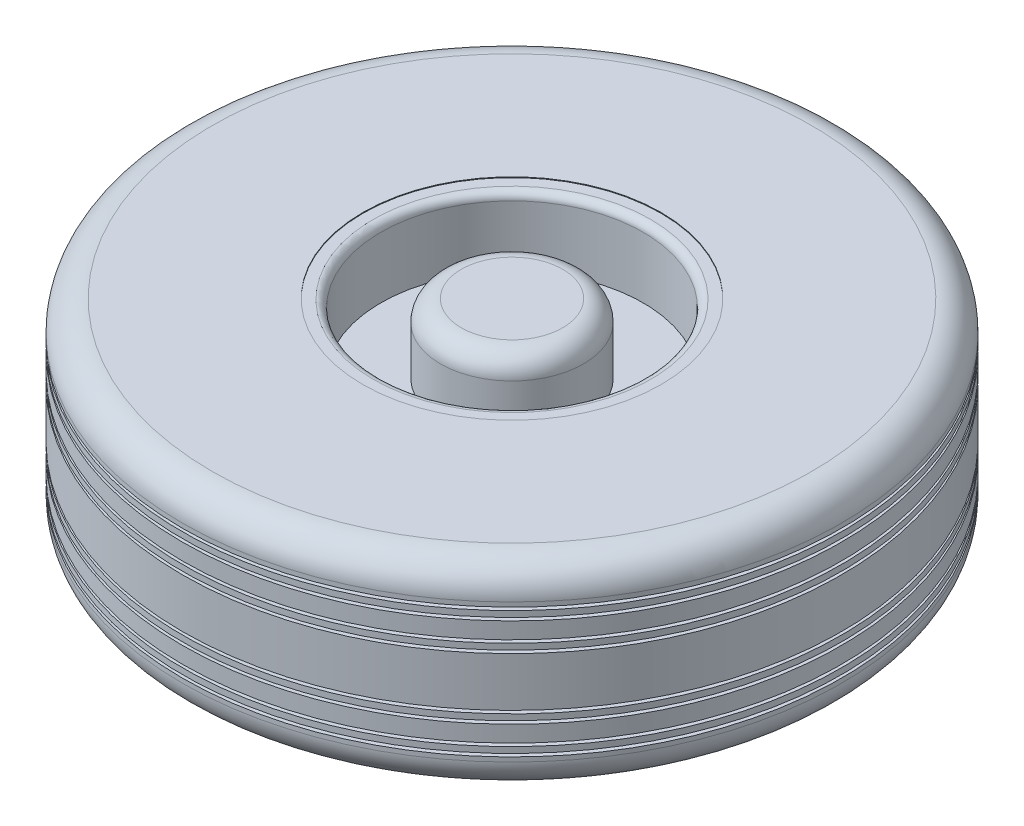
ISO-10303-21;
HEADER;
FILE_DESCRIPTION(('STEP AP214'),'2;1');
FILE_NAME('part.step','',(''),(''),'','','');
FILE_SCHEMA(('AUTOMOTIVE_DESIGN { 1 0 10303 214 1 1 1 1 }'));
ENDSEC;
DATA;
#1=APPLICATION_CONTEXT('core data for automotive mechanical design processes');
#2=APPLICATION_PROTOCOL_DEFINITION('international standard','automotive_design',2000,#1);
#3=PRODUCT_CONTEXT('',#1,'mechanical');
#4=PRODUCT('Part','Part','',(#3));
#5=PRODUCT_RELATED_PRODUCT_CATEGORY('part','',(#4));
#6=PRODUCT_DEFINITION_FORMATION('','',#4);
#7=PRODUCT_DEFINITION_CONTEXT('part definition',#1,'design');
#8=PRODUCT_DEFINITION('design','',#6,#7);
#9=PRODUCT_DEFINITION_SHAPE('','',#8);
#10=(LENGTH_UNIT() NAMED_UNIT(*) SI_UNIT(.MILLI.,.METRE.));
#11=(NAMED_UNIT(*) PLANE_ANGLE_UNIT() SI_UNIT($,.RADIAN.));
#12=(NAMED_UNIT(*) SI_UNIT($,.STERADIAN.) SOLID_ANGLE_UNIT());
#13=UNCERTAINTY_MEASURE_WITH_UNIT(LENGTH_MEASURE(1.E-05),#10,'distance_accuracy_value','');
#14=(GEOMETRIC_REPRESENTATION_CONTEXT(3) GLOBAL_UNCERTAINTY_ASSIGNED_CONTEXT((#13)) GLOBAL_UNIT_ASSIGNED_CONTEXT((#10,
#11,#12)) REPRESENTATION_CONTEXT('',''));
#15=CARTESIAN_POINT('',(0.,0.,0.));
#16=DIRECTION('',(0.,0.,1.));
#17=DIRECTION('',(1.,0.,0.));
#18=AXIS2_PLACEMENT_3D('',#15,#16,#17);
#19=CARTESIAN_POINT('',(0.,-47.6249999999999,0.));
#20=DIRECTION('',(0.,1.,0.));
#21=DIRECTION('',(0.,0.,1.));
#22=AXIS2_PLACEMENT_3D('',#19,#20,#21);
#23=PLANE('',#22);
#24=CARTESIAN_POINT('',(0.,-47.6249999999999,0.));
#25=DIRECTION('',(0.,-1.,0.));
#26=DIRECTION('',(0.,0.,-1.));
#27=AXIS2_PLACEMENT_3D('',#24,#25,#26);
#28=CIRCLE('',#27,269.24);
#29=CARTESIAN_POINT('',(0.,-47.6249999999999,-269.24));
#30=VERTEX_POINT('',#29);
#31=EDGE_CURVE('E81',#30,#30,#28,.T.);
#32=ORIENTED_EDGE('',*,*,#31,.T.);
#33=EDGE_LOOP('',(#32));
#34=FACE_BOUND('',#33,.T.);
#35=CARTESIAN_POINT('',(0.,-47.6249999999999,0.));
#36=DIRECTION('',(0.,-1.,0.));
#37=DIRECTION('',(0.,0.,-1.));
#38=AXIS2_PLACEMENT_3D('',#35,#36,#37);
#39=CIRCLE('',#38,280.67);
#40=CARTESIAN_POINT('',(0.,-47.6249999999999,-280.67));
#41=VERTEX_POINT('',#40);
#42=EDGE_CURVE('E12',#41,#41,#39,.T.);
#43=ORIENTED_EDGE('',*,*,#42,.F.);
#44=EDGE_LOOP('',(#43));
#45=FACE_BOUND('',#44,.T.);
#46=ADVANCED_FACE('F66',(#34,#45),#23,.T.);
#47=CARTESIAN_POINT('',(0.,0.,0.));
#48=DIRECTION('',(0.,-1.,0.));
#49=DIRECTION('',(0.,0.,-1.));
#50=AXIS2_PLACEMENT_3D('',#47,#48,#49);
#51=CYLINDRICAL_SURFACE('',#50,269.24);
#52=CARTESIAN_POINT('',(0.,-52.7049999999999,0.));
#53=DIRECTION('',(0.,-1.,0.));
#54=DIRECTION('',(0.,0.,-1.));
#55=AXIS2_PLACEMENT_3D('',#52,#53,#54);
#56=CIRCLE('',#55,269.24);
#57=CARTESIAN_POINT('',(0.,-52.7049999999999,-269.24));
#58=VERTEX_POINT('',#57);
#59=EDGE_CURVE('E77',#58,#58,#56,.T.);
#60=ORIENTED_EDGE('',*,*,#59,.T.);
#61=EDGE_LOOP('',(#60));
#62=FACE_BOUND('',#61,.T.);
#63=ORIENTED_EDGE('',*,*,#31,.F.);
#64=EDGE_LOOP('',(#63));
#65=FACE_BOUND('',#64,.T.);
#66=ADVANCED_FACE('F89',(#62,#65),#51,.F.);
#67=CARTESIAN_POINT('',(0.,-52.7049999999999,0.));
#68=DIRECTION('',(0.,-1.,0.));
#69=DIRECTION('',(0.,0.,-1.));
#70=AXIS2_PLACEMENT_3D('',#67,#68,#69);
#71=PLANE('',#70);
#72=CARTESIAN_POINT('',(0.,-52.7049999999999,0.));
#73=DIRECTION('',(0.,-1.,0.));
#74=DIRECTION('',(0.,0.,-1.));
#75=AXIS2_PLACEMENT_3D('',#72,#73,#74);
#76=CIRCLE('',#75,280.67);
#77=CARTESIAN_POINT('',(0.,-52.7049999999999,-280.67));
#78=VERTEX_POINT('',#77);
#79=EDGE_CURVE('E73',#78,#78,#76,.T.);
#80=ORIENTED_EDGE('',*,*,#79,.T.);
#81=EDGE_LOOP('',(#80));
#82=FACE_BOUND('',#81,.T.);
#83=ORIENTED_EDGE('',*,*,#59,.F.);
#84=EDGE_LOOP('',(#83));
#85=FACE_BOUND('',#84,.T.);
#86=ADVANCED_FACE('F91',(#82,#85),#71,.T.);
#87=CARTESIAN_POINT('',(0.,-84.455,0.));
#88=DIRECTION('',(0.,1.,0.));
#89=DIRECTION('',(0.,0.,1.));
#90=AXIS2_PLACEMENT_3D('',#87,#88,#89);
#91=CYLINDRICAL_SURFACE('',#90,280.67);
#92=ORIENTED_EDGE('',*,*,#79,.F.);
#93=EDGE_LOOP('',(#92));
#94=FACE_BOUND('',#93,.T.);
#95=ORIENTED_EDGE('',*,*,#42,.T.);
#96=EDGE_LOOP('',(#95));
#97=FACE_BOUND('',#96,.T.);
#98=ADVANCED_FACE('F68',(#94,#97),#91,.T.);
#99=CLOSED_SHELL('',(#46,#66,#86,#98));
#100=MANIFOLD_SOLID_BREP('B2',#99);
#101=CARTESIAN_POINT('',(0.,-23.4949999999999,0.));
#102=DIRECTION('',(0.,1.,0.));
#103=DIRECTION('',(0.,0.,1.));
#104=AXIS2_PLACEMENT_3D('',#101,#102,#103);
#105=PLANE('',#104);
#106=CARTESIAN_POINT('',(0.,-23.4949999999999,0.));
#107=DIRECTION('',(0.,-1.,0.));
#108=DIRECTION('',(0.,0.,-1.));
#109=AXIS2_PLACEMENT_3D('',#106,#107,#108);
#110=CIRCLE('',#109,269.24);
#111=CARTESIAN_POINT('',(0.,-23.4949999999999,-269.24));
#112=VERTEX_POINT('',#111);
#113=EDGE_CURVE('E155',#112,#112,#110,.T.);
#114=ORIENTED_EDGE('',*,*,#113,.T.);
#115=EDGE_LOOP('',(#114));
#116=FACE_BOUND('',#115,.T.);
#117=CARTESIAN_POINT('',(0.,-23.4949999999999,0.));
#118=DIRECTION('',(0.,-1.,0.));
#119=DIRECTION('',(0.,0.,-1.));
#120=AXIS2_PLACEMENT_3D('',#117,#118,#119);
#121=CIRCLE('',#120,280.67);
#122=CARTESIAN_POINT('',(0.,-23.4949999999999,-280.67));
#123=VERTEX_POINT('',#122);
#124=EDGE_CURVE('E65',#123,#123,#121,.T.);
#125=ORIENTED_EDGE('',*,*,#124,.F.);
#126=EDGE_LOOP('',(#125));
#127=FACE_BOUND('',#126,.T.);
#128=ADVANCED_FACE('F140',(#116,#127),#105,.T.);
#129=CARTESIAN_POINT('',(0.,0.,0.));
#130=DIRECTION('',(0.,-1.,0.));
#131=DIRECTION('',(0.,0.,-1.));
#132=AXIS2_PLACEMENT_3D('',#129,#130,#131);
#133=CYLINDRICAL_SURFACE('',#132,269.24);
#134=CARTESIAN_POINT('',(0.,-28.5749999999999,0.));
#135=DIRECTION('',(0.,-1.,0.));
#136=DIRECTION('',(0.,0.,-1.));
#137=AXIS2_PLACEMENT_3D('',#134,#135,#136);
#138=CIRCLE('',#137,269.24);
#139=CARTESIAN_POINT('',(0.,-28.5749999999999,-269.24));
#140=VERTEX_POINT('',#139);
#141=EDGE_CURVE('E151',#140,#140,#138,.T.);
#142=ORIENTED_EDGE('',*,*,#141,.T.);
#143=EDGE_LOOP('',(#142));
#144=FACE_BOUND('',#143,.T.);
#145=ORIENTED_EDGE('',*,*,#113,.F.);
#146=EDGE_LOOP('',(#145));
#147=FACE_BOUND('',#146,.T.);
#148=ADVANCED_FACE('F163',(#144,#147),#133,.F.);
#149=CARTESIAN_POINT('',(0.,-28.5749999999999,0.));
#150=DIRECTION('',(0.,-1.,0.));
#151=DIRECTION('',(0.,0.,-1.));
#152=AXIS2_PLACEMENT_3D('',#149,#150,#151);
#153=PLANE('',#152);
#154=CARTESIAN_POINT('',(0.,-28.5749999999999,0.));
#155=DIRECTION('',(0.,-1.,0.));
#156=DIRECTION('',(0.,0.,-1.));
#157=AXIS2_PLACEMENT_3D('',#154,#155,#156);
#158=CIRCLE('',#157,280.67);
#159=CARTESIAN_POINT('',(0.,-28.5749999999999,-280.67));
#160=VERTEX_POINT('',#159);
#161=EDGE_CURVE('E147',#160,#160,#158,.T.);
#162=ORIENTED_EDGE('',*,*,#161,.T.);
#163=EDGE_LOOP('',(#162));
#164=FACE_BOUND('',#163,.T.);
#165=ORIENTED_EDGE('',*,*,#141,.F.);
#166=EDGE_LOOP('',(#165));
#167=FACE_BOUND('',#166,.T.);
#168=ADVANCED_FACE('F165',(#164,#167),#153,.T.);
#169=CARTESIAN_POINT('',(0.,-84.455,0.));
#170=DIRECTION('',(0.,1.,0.));
#171=DIRECTION('',(0.,0.,1.));
#172=AXIS2_PLACEMENT_3D('',#169,#170,#171);
#173=CYLINDRICAL_SURFACE('',#172,280.67);
#174=ORIENTED_EDGE('',*,*,#161,.F.);
#175=EDGE_LOOP('',(#174));
#176=FACE_BOUND('',#175,.T.);
#177=ORIENTED_EDGE('',*,*,#124,.T.);
#178=EDGE_LOOP('',(#177));
#179=FACE_BOUND('',#178,.T.);
#180=ADVANCED_FACE('F142',(#176,#179),#173,.T.);
#181=CLOSED_SHELL('',(#128,#148,#168,#180));
#182=MANIFOLD_SOLID_BREP('B7',#181);
#183=CARTESIAN_POINT('',(0.,23.4949999999999,0.));
#184=DIRECTION('',(0.,1.,0.));
#185=DIRECTION('',(0.,0.,1.));
#186=AXIS2_PLACEMENT_3D('',#183,#184,#185);
#187=PLANE('',#186);
#188=CARTESIAN_POINT('',(0.,23.4949999999999,0.));
#189=DIRECTION('',(0.,-1.,0.));
#190=DIRECTION('',(0.,0.,-1.));
#191=AXIS2_PLACEMENT_3D('',#188,#189,#190);
#192=CIRCLE('',#191,269.24);
#193=CARTESIAN_POINT('',(0.,23.4949999999999,-269.24));
#194=VERTEX_POINT('',#193);
#195=EDGE_CURVE('E225',#194,#194,#192,.T.);
#196=ORIENTED_EDGE('',*,*,#195,.F.);
#197=EDGE_LOOP('',(#196));
#198=FACE_BOUND('',#197,.T.);
#199=CARTESIAN_POINT('',(0.,23.4949999999999,0.));
#200=DIRECTION('',(0.,-1.,0.));
#201=DIRECTION('',(0.,0.,-1.));
#202=AXIS2_PLACEMENT_3D('',#199,#200,#201);
#203=CIRCLE('',#202,280.67);
#204=CARTESIAN_POINT('',(0.,23.4949999999999,-280.67));
#205=VERTEX_POINT('',#204);
#206=EDGE_CURVE('E229',#205,#205,#203,.T.);
#207=ORIENTED_EDGE('',*,*,#206,.T.);
#208=EDGE_LOOP('',(#207));
#209=FACE_BOUND('',#208,.T.);
#210=ADVANCED_FACE('F214',(#198,#209),#187,.F.);
#211=CARTESIAN_POINT('',(0.,0.,0.));
#212=DIRECTION('',(0.,-1.,0.));
#213=DIRECTION('',(0.,0.,-1.));
#214=AXIS2_PLACEMENT_3D('',#211,#212,#213);
#215=CYLINDRICAL_SURFACE('',#214,269.24);
#216=CARTESIAN_POINT('',(0.,28.5749999999999,0.));
#217=DIRECTION('',(0.,-1.,0.));
#218=DIRECTION('',(0.,0.,-1.));
#219=AXIS2_PLACEMENT_3D('',#216,#217,#218);
#220=CIRCLE('',#219,269.24);
#221=CARTESIAN_POINT('',(0.,28.5749999999999,-269.24));
#222=VERTEX_POINT('',#221);
#223=EDGE_CURVE('E221',#222,#222,#220,.T.);
#224=ORIENTED_EDGE('',*,*,#223,.F.);
#225=EDGE_LOOP('',(#224));
#226=FACE_BOUND('',#225,.T.);
#227=ORIENTED_EDGE('',*,*,#195,.T.);
#228=EDGE_LOOP('',(#227));
#229=FACE_BOUND('',#228,.T.);
#230=ADVANCED_FACE('F241',(#226,#229),#215,.F.);
#231=CARTESIAN_POINT('',(0.,28.5749999999999,0.));
#232=DIRECTION('',(0.,-1.,0.));
#233=DIRECTION('',(0.,0.,-1.));
#234=AXIS2_PLACEMENT_3D('',#231,#232,#233);
#235=PLANE('',#234);
#236=CARTESIAN_POINT('',(0.,28.5749999999999,0.));
#237=DIRECTION('',(0.,-1.,0.));
#238=DIRECTION('',(0.,0.,-1.));
#239=AXIS2_PLACEMENT_3D('',#236,#237,#238);
#240=CIRCLE('',#239,280.67);
#241=CARTESIAN_POINT('',(0.,28.5749999999999,-280.67));
#242=VERTEX_POINT('',#241);
#243=EDGE_CURVE('E139',#242,#242,#240,.T.);
#244=ORIENTED_EDGE('',*,*,#243,.F.);
#245=EDGE_LOOP('',(#244));
#246=FACE_BOUND('',#245,.T.);
#247=ORIENTED_EDGE('',*,*,#223,.T.);
#248=EDGE_LOOP('',(#247));
#249=FACE_BOUND('',#248,.T.);
#250=ADVANCED_FACE('F237',(#246,#249),#235,.F.);
#251=CARTESIAN_POINT('',(0.,-84.455,0.));
#252=DIRECTION('',(0.,1.,0.));
#253=DIRECTION('',(0.,0.,1.));
#254=AXIS2_PLACEMENT_3D('',#251,#252,#253);
#255=CYLINDRICAL_SURFACE('',#254,280.67);
#256=ORIENTED_EDGE('',*,*,#206,.F.);
#257=EDGE_LOOP('',(#256));
#258=FACE_BOUND('',#257,.T.);
#259=ORIENTED_EDGE('',*,*,#243,.T.);
#260=EDGE_LOOP('',(#259));
#261=FACE_BOUND('',#260,.T.);
#262=ADVANCED_FACE('F216',(#258,#261),#255,.T.);
#263=CLOSED_SHELL('',(#210,#230,#250,#262));
#264=MANIFOLD_SOLID_BREP('B60',#263);
#265=CARTESIAN_POINT('',(0.,52.7049999999999,0.));
#266=DIRECTION('',(0.,-1.,0.));
#267=DIRECTION('',(0.,0.,-1.));
#268=AXIS2_PLACEMENT_3D('',#265,#266,#267);
#269=PLANE('',#268);
#270=CARTESIAN_POINT('',(0.,52.7049999999999,0.));
#271=DIRECTION('',(0.,-1.,0.));
#272=DIRECTION('',(0.,0.,-1.));
#273=AXIS2_PLACEMENT_3D('',#270,#271,#272);
#274=CIRCLE('',#273,280.67);
#275=CARTESIAN_POINT('',(0.,52.7049999999999,-280.67));
#276=VERTEX_POINT('',#275);
#277=EDGE_CURVE('E213',#276,#276,#274,.T.);
#278=ORIENTED_EDGE('',*,*,#277,.F.);
#279=EDGE_LOOP('',(#278));
#280=FACE_BOUND('',#279,.T.);
#281=CARTESIAN_POINT('',(0.,52.7049999999999,0.));
#282=DIRECTION('',(0.,-1.,0.));
#283=DIRECTION('',(0.,0.,-1.));
#284=AXIS2_PLACEMENT_3D('',#281,#282,#283);
#285=CIRCLE('',#284,269.24);
#286=CARTESIAN_POINT('',(0.,52.7049999999999,-269.24));
#287=VERTEX_POINT('',#286);
#288=EDGE_CURVE('E291',#287,#287,#285,.T.);
#289=ORIENTED_EDGE('',*,*,#288,.T.);
#290=EDGE_LOOP('',(#289));
#291=FACE_BOUND('',#290,.T.);
#292=ADVANCED_FACE('F287',(#280,#291),#269,.F.);
#293=CARTESIAN_POINT('',(0.,47.6249999999999,0.));
#294=DIRECTION('',(0.,1.,0.));
#295=DIRECTION('',(0.,0.,1.));
#296=AXIS2_PLACEMENT_3D('',#293,#294,#295);
#297=PLANE('',#296);
#298=CARTESIAN_POINT('',(0.,47.6249999999999,0.));
#299=DIRECTION('',(0.,-1.,0.));
#300=DIRECTION('',(0.,0.,-1.));
#301=AXIS2_PLACEMENT_3D('',#298,#299,#300);
#302=CIRCLE('',#301,269.24);
#303=CARTESIAN_POINT('',(0.,47.6249999999999,-269.24));
#304=VERTEX_POINT('',#303);
#305=EDGE_CURVE('E295',#304,#304,#302,.T.);
#306=ORIENTED_EDGE('',*,*,#305,.F.);
#307=EDGE_LOOP('',(#306));
#308=FACE_BOUND('',#307,.T.);
#309=CARTESIAN_POINT('',(0.,47.6249999999999,0.));
#310=DIRECTION('',(0.,-1.,0.));
#311=DIRECTION('',(0.,0.,-1.));
#312=AXIS2_PLACEMENT_3D('',#309,#310,#311);
#313=CIRCLE('',#312,280.67);
#314=CARTESIAN_POINT('',(0.,47.6249999999999,-280.67));
#315=VERTEX_POINT('',#314);
#316=EDGE_CURVE('E300',#315,#315,#313,.T.);
#317=ORIENTED_EDGE('',*,*,#316,.T.);
#318=EDGE_LOOP('',(#317));
#319=FACE_BOUND('',#318,.T.);
#320=ADVANCED_FACE('F312',(#308,#319),#297,.F.);
#321=CARTESIAN_POINT('',(0.,0.,0.));
#322=DIRECTION('',(0.,-1.,0.));
#323=DIRECTION('',(0.,0.,-1.));
#324=AXIS2_PLACEMENT_3D('',#321,#322,#323);
#325=CYLINDRICAL_SURFACE('',#324,269.24);
#326=ORIENTED_EDGE('',*,*,#288,.F.);
#327=EDGE_LOOP('',(#326));
#328=FACE_BOUND('',#327,.T.);
#329=ORIENTED_EDGE('',*,*,#305,.T.);
#330=EDGE_LOOP('',(#329));
#331=FACE_BOUND('',#330,.T.);
#332=ADVANCED_FACE('F309',(#328,#331),#325,.F.);
#333=CARTESIAN_POINT('',(0.,-84.455,0.));
#334=DIRECTION('',(0.,1.,0.));
#335=DIRECTION('',(0.,0.,1.));
#336=AXIS2_PLACEMENT_3D('',#333,#334,#335);
#337=CYLINDRICAL_SURFACE('',#336,280.67);
#338=ORIENTED_EDGE('',*,*,#277,.T.);
#339=EDGE_LOOP('',(#338));
#340=FACE_BOUND('',#339,.T.);
#341=ORIENTED_EDGE('',*,*,#316,.F.);
#342=EDGE_LOOP('',(#341));
#343=FACE_BOUND('',#342,.T.);
#344=ADVANCED_FACE('F289',(#340,#343),#337,.T.);
#345=CLOSED_SHELL('',(#292,#320,#332,#344));
#346=MANIFOLD_SOLID_BREP('B134',#345);
#347=CARTESIAN_POINT('',(0.,-83.82,0.));
#348=DIRECTION('',(0.,1.,0.));
#349=DIRECTION('',(0.,0.,1.));
#350=AXIS2_PLACEMENT_3D('',#347,#348,#349);
#351=CYLINDRICAL_SURFACE('',#350,111.76);
#352=CARTESIAN_POINT('',(0.,-83.82,0.));
#353=DIRECTION('',(0.,1.,0.));
#354=DIRECTION('',(0.,0.,1.));
#355=AXIS2_PLACEMENT_3D('',#352,#353,#354);
#356=CIRCLE('',#355,111.76);
#357=CARTESIAN_POINT('',(0.,-83.82,111.76));
#358=VERTEX_POINT('',#357);
#359=EDGE_CURVE('E423',#358,#358,#356,.T.);
#360=ORIENTED_EDGE('',*,*,#359,.F.);
#361=EDGE_LOOP('',(#360));
#362=FACE_BOUND('',#361,.T.);
#363=CARTESIAN_POINT('',(0.,-25.4,0.));
#364=DIRECTION('',(0.,1.,0.));
#365=DIRECTION('',(0.,0.,1.));
#366=AXIS2_PLACEMENT_3D('',#363,#364,#365);
#367=CIRCLE('',#366,111.76);
#368=CARTESIAN_POINT('',(0.,-25.4,111.76));
#369=VERTEX_POINT('',#368);
#370=EDGE_CURVE('E364',#369,#369,#367,.F.);
#371=ORIENTED_EDGE('',*,*,#370,.F.);
#372=EDGE_LOOP('',(#371));
#373=FACE_BOUND('',#372,.T.);
#374=ADVANCED_FACE('F353',(#362,#373),#351,.F.);
#375=CARTESIAN_POINT('',(0.,-84.455,0.));
#376=DIRECTION('',(0.,1.,0.));
#377=DIRECTION('',(0.,0.,1.));
#378=AXIS2_PLACEMENT_3D('',#375,#376,#377);
#379=CYLINDRICAL_SURFACE('',#378,127.);
#380=CARTESIAN_POINT('',(0.,-84.455,0.));
#381=DIRECTION('',(0.,1.,0.));
#382=DIRECTION('',(0.,0.,1.));
#383=AXIS2_PLACEMENT_3D('',#380,#381,#382);
#384=CIRCLE('',#383,127.);
#385=CARTESIAN_POINT('',(0.,-84.455,127.));
#386=VERTEX_POINT('',#385);
#387=EDGE_CURVE('E385',#386,#386,#384,.T.);
#388=ORIENTED_EDGE('',*,*,#387,.F.);
#389=EDGE_LOOP('',(#388));
#390=FACE_BOUND('',#389,.T.);
#391=CARTESIAN_POINT('',(0.,-83.82,0.));
#392=DIRECTION('',(0.,1.,0.));
#393=DIRECTION('',(0.,0.,1.));
#394=AXIS2_PLACEMENT_3D('',#391,#392,#393);
#395=CIRCLE('',#394,127.);
#396=CARTESIAN_POINT('',(0.,-83.82,127.));
#397=VERTEX_POINT('',#396);
#398=EDGE_CURVE('E368',#397,#397,#395,.F.);
#399=ORIENTED_EDGE('',*,*,#398,.F.);
#400=EDGE_LOOP('',(#399));
#401=FACE_BOUND('',#400,.T.);
#402=ADVANCED_FACE('F489',(#390,#401),#379,.F.);
#403=CARTESIAN_POINT('',(0.,-84.455,0.));
#404=DIRECTION('',(0.,1.,0.));
#405=DIRECTION('',(0.,0.,1.));
#406=AXIS2_PLACEMENT_3D('',#403,#404,#405);
#407=CYLINDRICAL_SURFACE('',#406,280.67);
#408=CARTESIAN_POINT('',(0.,59.055,0.));
#409=DIRECTION('',(0.,1.,0.));
#410=DIRECTION('',(0.,0.,1.));
#411=AXIS2_PLACEMENT_3D('',#408,#409,#410);
#412=CIRCLE('',#411,280.67);
#413=CARTESIAN_POINT('',(0.,59.055,280.67));
#414=VERTEX_POINT('',#413);
#415=EDGE_CURVE('E379',#414,#414,#412,.F.);
#416=ORIENTED_EDGE('',*,*,#415,.T.);
#417=EDGE_LOOP('',(#416));
#418=FACE_BOUND('',#417,.T.);
#419=CARTESIAN_POINT('',(0.,55.2449999999999,0.));
#420=DIRECTION('',(0.,-1.,0.));
#421=DIRECTION('',(0.,0.,-1.));
#422=AXIS2_PLACEMENT_3D('',#419,#420,#421);
#423=CIRCLE('',#422,280.67);
#424=CARTESIAN_POINT('',(0.,55.2449999999999,-280.67));
#425=VERTEX_POINT('',#424);
#426=EDGE_CURVE('E386',#425,#425,#423,.F.);
#427=ORIENTED_EDGE('',*,*,#426,.T.);
#428=EDGE_LOOP('',(#427));
#429=FACE_BOUND('',#428,.T.);
#430=ADVANCED_FACE('F496',(#418,#429),#407,.T.);
#431=CARTESIAN_POINT('',(0.,-59.055,0.));
#432=DIRECTION('',(0.,1.,0.));
#433=DIRECTION('',(0.,0.,1.));
#434=AXIS2_PLACEMENT_3D('',#431,#432,#433);
#435=CIRCLE('',#434,280.67);
#436=CARTESIAN_POINT('',(0.,-59.055,280.67));
#437=VERTEX_POINT('',#436);
#438=EDGE_CURVE('E376',#437,#437,#435,.T.);
#439=ORIENTED_EDGE('',*,*,#438,.T.);
#440=EDGE_LOOP('',(#439));
#441=FACE_BOUND('',#440,.T.);
#442=CARTESIAN_POINT('',(0.,-55.2449999999999,0.));
#443=DIRECTION('',(0.,-1.,0.));
#444=DIRECTION('',(0.,0.,-1.));
#445=AXIS2_PLACEMENT_3D('',#442,#443,#444);
#446=CIRCLE('',#445,280.67);
#447=CARTESIAN_POINT('',(0.,-55.2449999999999,-280.67));
#448=VERTEX_POINT('',#447);
#449=EDGE_CURVE('E408',#448,#448,#446,.F.);
#450=ORIENTED_EDGE('',*,*,#449,.F.);
#451=EDGE_LOOP('',(#450));
#452=FACE_BOUND('',#451,.T.);
#453=ADVANCED_FACE('F565',(#441,#452),#407,.T.);
#454=CARTESIAN_POINT('',(0.,-84.455,0.));
#455=DIRECTION('',(0.,1.,0.));
#456=DIRECTION('',(0.,0.,1.));
#457=AXIS2_PLACEMENT_3D('',#454,#455,#456);
#458=PLANE('',#457);
#459=CARTESIAN_POINT('',(0.,-84.455,0.));
#460=DIRECTION('',(0.,1.,0.));
#461=DIRECTION('',(0.,0.,1.));
#462=AXIS2_PLACEMENT_3D('',#459,#460,#461);
#463=CIRCLE('',#462,255.27);
#464=CARTESIAN_POINT('',(0.,-84.455,255.27));
#465=VERTEX_POINT('',#464);
#466=EDGE_CURVE('E373',#465,#465,#463,.F.);
#467=ORIENTED_EDGE('',*,*,#466,.T.);
#468=EDGE_LOOP('',(#467));
#469=FACE_BOUND('',#468,.T.);
#470=ORIENTED_EDGE('',*,*,#387,.T.);
#471=EDGE_LOOP('',(#470));
#472=FACE_BOUND('',#471,.T.);
#473=ADVANCED_FACE('F547',(#469,#472),#458,.F.);
#474=CARTESIAN_POINT('',(0.,83.82,0.));
#475=DIRECTION('',(0.,1.,0.));
#476=DIRECTION('',(0.,0.,1.));
#477=AXIS2_PLACEMENT_3D('',#474,#475,#476);
#478=CIRCLE('',#477,127.);
#479=CARTESIAN_POINT('',(0.,83.82,127.));
#480=VERTEX_POINT('',#479);
#481=EDGE_CURVE('E442',#480,#480,#478,.T.);
#482=ORIENTED_EDGE('',*,*,#481,.F.);
#483=EDGE_LOOP('',(#482));
#484=FACE_BOUND('',#483,.T.);
#485=CARTESIAN_POINT('',(0.,84.455,0.));
#486=DIRECTION('',(0.,1.,0.));
#487=DIRECTION('',(0.,0.,1.));
#488=AXIS2_PLACEMENT_3D('',#485,#486,#487);
#489=CIRCLE('',#488,127.);
#490=CARTESIAN_POINT('',(0.,84.455,127.));
#491=VERTEX_POINT('',#490);
#492=EDGE_CURVE('E389',#491,#491,#489,.T.);
#493=ORIENTED_EDGE('',*,*,#492,.T.);
#494=EDGE_LOOP('',(#493));
#495=FACE_BOUND('',#494,.T.);
#496=ADVANCED_FACE('F499',(#484,#495),#379,.F.);
#497=CARTESIAN_POINT('',(0.,84.455,0.));
#498=DIRECTION('',(0.,1.,0.));
#499=DIRECTION('',(0.,0.,1.));
#500=AXIS2_PLACEMENT_3D('',#497,#498,#499);
#501=PLANE('',#500);
#502=CARTESIAN_POINT('',(0.,84.455,0.));
#503=DIRECTION('',(0.,1.,0.));
#504=DIRECTION('',(0.,0.,1.));
#505=AXIS2_PLACEMENT_3D('',#502,#503,#504);
#506=CIRCLE('',#505,255.27);
#507=CARTESIAN_POINT('',(0.,84.455,255.27));
#508=VERTEX_POINT('',#507);
#509=EDGE_CURVE('E382',#508,#508,#506,.T.);
#510=ORIENTED_EDGE('',*,*,#509,.T.);
#511=EDGE_LOOP('',(#510));
#512=FACE_BOUND('',#511,.T.);
#513=ORIENTED_EDGE('',*,*,#492,.F.);
#514=EDGE_LOOP('',(#513));
#515=FACE_BOUND('',#514,.T.);
#516=ADVANCED_FACE('F546',(#512,#515),#501,.T.);
#517=CARTESIAN_POINT('',(0.,-45.0849999999999,0.));
#518=DIRECTION('',(0.,1.,0.));
#519=DIRECTION('',(0.,0.,1.));
#520=AXIS2_PLACEMENT_3D('',#517,#518,#519);
#521=PLANE('',#520);
#522=CARTESIAN_POINT('',(0.,-45.0849999999999,0.));
#523=DIRECTION('',(0.,1.,0.));
#524=DIRECTION('',(0.,0.,1.));
#525=AXIS2_PLACEMENT_3D('',#522,#523,#524);
#526=CIRCLE('',#525,280.67);
#527=CARTESIAN_POINT('',(0.,-45.0849999999999,280.67));
#528=VERTEX_POINT('',#527);
#529=EDGE_CURVE('E405',#528,#528,#526,.F.);
#530=ORIENTED_EDGE('',*,*,#529,.T.);
#531=EDGE_LOOP('',(#530));
#532=FACE_BOUND('',#531,.T.);
#533=CARTESIAN_POINT('',(0.,-45.0849999999999,0.));
#534=DIRECTION('',(0.,-1.,0.));
#535=DIRECTION('',(0.,0.,-1.));
#536=AXIS2_PLACEMENT_3D('',#533,#534,#535);
#537=CIRCLE('',#536,266.7);
#538=CARTESIAN_POINT('',(0.,-45.0849999999999,-266.7));
#539=VERTEX_POINT('',#538);
#540=EDGE_CURVE('E416',#539,#539,#537,.T.);
#541=ORIENTED_EDGE('',*,*,#540,.F.);
#542=EDGE_LOOP('',(#541));
#543=FACE_BOUND('',#542,.T.);
#544=ADVANCED_FACE('F551',(#532,#543),#521,.F.);
#545=CARTESIAN_POINT('',(0.,0.,0.));
#546=DIRECTION('',(0.,-1.,0.));
#547=DIRECTION('',(0.,0.,-1.));
#548=AXIS2_PLACEMENT_3D('',#545,#546,#547);
#549=CYLINDRICAL_SURFACE('',#548,266.7);
#550=CARTESIAN_POINT('',(0.,-55.2449999999999,0.));
#551=DIRECTION('',(0.,-1.,0.));
#552=DIRECTION('',(0.,0.,-1.));
#553=AXIS2_PLACEMENT_3D('',#550,#551,#552);
#554=CIRCLE('',#553,266.7);
#555=CARTESIAN_POINT('',(0.,-55.2449999999999,-266.7));
#556=VERTEX_POINT('',#555);
#557=EDGE_CURVE('E420',#556,#556,#554,.T.);
#558=ORIENTED_EDGE('',*,*,#557,.F.);
#559=EDGE_LOOP('',(#558));
#560=FACE_BOUND('',#559,.T.);
#561=ORIENTED_EDGE('',*,*,#540,.T.);
#562=EDGE_LOOP('',(#561));
#563=FACE_BOUND('',#562,.T.);
#564=ADVANCED_FACE('F558',(#560,#563),#549,.T.);
#565=CARTESIAN_POINT('',(0.,-55.2449999999999,0.));
#566=DIRECTION('',(0.,-1.,0.));
#567=DIRECTION('',(0.,0.,-1.));
#568=AXIS2_PLACEMENT_3D('',#565,#566,#567);
#569=PLANE('',#568);
#570=ORIENTED_EDGE('',*,*,#449,.T.);
#571=EDGE_LOOP('',(#570));
#572=FACE_BOUND('',#571,.T.);
#573=ORIENTED_EDGE('',*,*,#557,.T.);
#574=EDGE_LOOP('',(#573));
#575=FACE_BOUND('',#574,.T.);
#576=ADVANCED_FACE('F630',(#572,#575),#569,.F.);
#577=CARTESIAN_POINT('',(0.,-31.1149999999999,0.));
#578=DIRECTION('',(0.,-1.,0.));
#579=DIRECTION('',(0.,0.,-1.));
#580=AXIS2_PLACEMENT_3D('',#577,#578,#579);
#581=CIRCLE('',#580,280.67);
#582=CARTESIAN_POINT('',(0.,-31.1149999999999,-280.67));
#583=VERTEX_POINT('',#582);
#584=EDGE_CURVE('E402',#583,#583,#581,.F.);
#585=ORIENTED_EDGE('',*,*,#584,.F.);
#586=EDGE_LOOP('',(#585));
#587=FACE_BOUND('',#586,.T.);
#588=ORIENTED_EDGE('',*,*,#529,.F.);
#589=EDGE_LOOP('',(#588));
#590=FACE_BOUND('',#589,.T.);
#591=ADVANCED_FACE('F570',(#587,#590),#407,.T.);
#592=CARTESIAN_POINT('',(0.,-20.9549999999999,0.));
#593=DIRECTION('',(0.,1.,0.));
#594=DIRECTION('',(0.,0.,1.));
#595=AXIS2_PLACEMENT_3D('',#592,#593,#594);
#596=PLANE('',#595);
#597=CARTESIAN_POINT('',(0.,-20.9549999999999,0.));
#598=DIRECTION('',(0.,1.,0.));
#599=DIRECTION('',(0.,0.,1.));
#600=AXIS2_PLACEMENT_3D('',#597,#598,#599);
#601=CIRCLE('',#600,280.67);
#602=CARTESIAN_POINT('',(0.,-20.9549999999999,280.67));
#603=VERTEX_POINT('',#602);
#604=EDGE_CURVE('E399',#603,#603,#601,.F.);
#605=ORIENTED_EDGE('',*,*,#604,.T.);
#606=EDGE_LOOP('',(#605));
#607=FACE_BOUND('',#606,.T.);
#608=CARTESIAN_POINT('',(0.,-20.9549999999999,0.));
#609=DIRECTION('',(0.,-1.,0.));
#610=DIRECTION('',(0.,0.,-1.));
#611=AXIS2_PLACEMENT_3D('',#608,#609,#610);
#612=CIRCLE('',#611,266.7);
#613=CARTESIAN_POINT('',(0.,-20.9549999999999,-266.7));
#614=VERTEX_POINT('',#613);
#615=EDGE_CURVE('E424',#614,#614,#612,.T.);
#616=ORIENTED_EDGE('',*,*,#615,.F.);
#617=EDGE_LOOP('',(#616));
#618=FACE_BOUND('',#617,.T.);
#619=ADVANCED_FACE('F625',(#607,#618),#596,.F.);
#620=CARTESIAN_POINT('',(0.,0.,0.));
#621=DIRECTION('',(0.,-1.,0.));
#622=DIRECTION('',(0.,0.,-1.));
#623=AXIS2_PLACEMENT_3D('',#620,#621,#622);
#624=CYLINDRICAL_SURFACE('',#623,266.7);
#625=CARTESIAN_POINT('',(0.,-31.1149999999999,0.));
#626=DIRECTION('',(0.,-1.,0.));
#627=DIRECTION('',(0.,0.,-1.));
#628=AXIS2_PLACEMENT_3D('',#625,#626,#627);
#629=CIRCLE('',#628,266.7);
#630=CARTESIAN_POINT('',(0.,-31.1149999999999,-266.7));
#631=VERTEX_POINT('',#630);
#632=EDGE_CURVE('E419',#631,#631,#629,.T.);
#633=ORIENTED_EDGE('',*,*,#632,.F.);
#634=EDGE_LOOP('',(#633));
#635=FACE_BOUND('',#634,.T.);
#636=ORIENTED_EDGE('',*,*,#615,.T.);
#637=EDGE_LOOP('',(#636));
#638=FACE_BOUND('',#637,.T.);
#639=ADVANCED_FACE('F621',(#635,#638),#624,.T.);
#640=CARTESIAN_POINT('',(0.,-31.1149999999999,0.));
#641=DIRECTION('',(0.,-1.,0.));
#642=DIRECTION('',(0.,0.,-1.));
#643=AXIS2_PLACEMENT_3D('',#640,#641,#642);
#644=PLANE('',#643);
#645=ORIENTED_EDGE('',*,*,#584,.T.);
#646=EDGE_LOOP('',(#645));
#647=FACE_BOUND('',#646,.T.);
#648=ORIENTED_EDGE('',*,*,#632,.T.);
#649=EDGE_LOOP('',(#648));
#650=FACE_BOUND('',#649,.T.);
#651=ADVANCED_FACE('F618',(#647,#650),#644,.F.);
#652=ORIENTED_EDGE('',*,*,#604,.F.);
#653=EDGE_LOOP('',(#652));
#654=FACE_BOUND('',#653,.T.);
#655=CARTESIAN_POINT('',(0.,20.9549999999999,0.));
#656=DIRECTION('',(0.,1.,0.));
#657=DIRECTION('',(0.,0.,1.));
#658=AXIS2_PLACEMENT_3D('',#655,#656,#657);
#659=CIRCLE('',#658,280.67);
#660=CARTESIAN_POINT('',(0.,20.9549999999999,280.67));
#661=VERTEX_POINT('',#660);
#662=EDGE_CURVE('E393',#661,#661,#659,.F.);
#663=ORIENTED_EDGE('',*,*,#662,.T.);
#664=EDGE_LOOP('',(#663));
#665=FACE_BOUND('',#664,.T.);
#666=ADVANCED_FACE('F579',(#654,#665),#407,.T.);
#667=CARTESIAN_POINT('',(0.,20.9549999999999,0.));
#668=DIRECTION('',(0.,1.,0.));
#669=DIRECTION('',(0.,0.,1.));
#670=AXIS2_PLACEMENT_3D('',#667,#668,#669);
#671=PLANE('',#670);
#672=ORIENTED_EDGE('',*,*,#662,.F.);
#673=EDGE_LOOP('',(#672));
#674=FACE_BOUND('',#673,.T.);
#675=CARTESIAN_POINT('',(0.,20.9549999999999,0.));
#676=DIRECTION('',(0.,-1.,0.));
#677=DIRECTION('',(0.,0.,-1.));
#678=AXIS2_PLACEMENT_3D('',#675,#676,#677);
#679=CIRCLE('',#678,266.7);
#680=CARTESIAN_POINT('',(0.,20.9549999999999,-266.7));
#681=VERTEX_POINT('',#680);
#682=EDGE_CURVE('E430',#681,#681,#679,.T.);
#683=ORIENTED_EDGE('',*,*,#682,.T.);
#684=EDGE_LOOP('',(#683));
#685=FACE_BOUND('',#684,.T.);
#686=ADVANCED_FACE('F613',(#674,#685),#671,.T.);
#687=CARTESIAN_POINT('',(0.,0.,0.));
#688=DIRECTION('',(0.,-1.,0.));
#689=DIRECTION('',(0.,0.,-1.));
#690=AXIS2_PLACEMENT_3D('',#687,#688,#689);
#691=CYLINDRICAL_SURFACE('',#690,266.7);
#692=CARTESIAN_POINT('',(0.,31.1149999999999,0.));
#693=DIRECTION('',(0.,-1.,0.));
#694=DIRECTION('',(0.,0.,-1.));
#695=AXIS2_PLACEMENT_3D('',#692,#693,#694);
#696=CIRCLE('',#695,266.7);
#697=CARTESIAN_POINT('',(0.,31.1149999999999,-266.7));
#698=VERTEX_POINT('',#697);
#699=EDGE_CURVE('E427',#698,#698,#696,.T.);
#700=ORIENTED_EDGE('',*,*,#699,.T.);
#701=EDGE_LOOP('',(#700));
#702=FACE_BOUND('',#701,.T.);
#703=ORIENTED_EDGE('',*,*,#682,.F.);
#704=EDGE_LOOP('',(#703));
#705=FACE_BOUND('',#704,.T.);
#706=ADVANCED_FACE('F609',(#702,#705),#691,.T.);
#707=CARTESIAN_POINT('',(0.,31.1149999999999,0.));
#708=DIRECTION('',(0.,-1.,0.));
#709=DIRECTION('',(0.,0.,-1.));
#710=AXIS2_PLACEMENT_3D('',#707,#708,#709);
#711=PLANE('',#710);
#712=CARTESIAN_POINT('',(0.,31.1149999999999,0.));
#713=DIRECTION('',(0.,-1.,0.));
#714=DIRECTION('',(0.,0.,-1.));
#715=AXIS2_PLACEMENT_3D('',#712,#713,#714);
#716=CIRCLE('',#715,280.67);
#717=CARTESIAN_POINT('',(0.,31.1149999999999,-280.67));
#718=VERTEX_POINT('',#717);
#719=EDGE_CURVE('E396',#718,#718,#716,.F.);
#720=ORIENTED_EDGE('',*,*,#719,.F.);
#721=EDGE_LOOP('',(#720));
#722=FACE_BOUND('',#721,.T.);
#723=ORIENTED_EDGE('',*,*,#699,.F.);
#724=EDGE_LOOP('',(#723));
#725=FACE_BOUND('',#724,.T.);
#726=ADVANCED_FACE('F592',(#722,#725),#711,.T.);
#727=CARTESIAN_POINT('',(0.,55.2449999999999,0.));
#728=DIRECTION('',(0.,-1.,0.));
#729=DIRECTION('',(0.,0.,-1.));
#730=AXIS2_PLACEMENT_3D('',#727,#728,#729);
#731=PLANE('',#730);
#732=ORIENTED_EDGE('',*,*,#426,.F.);
#733=EDGE_LOOP('',(#732));
#734=FACE_BOUND('',#733,.T.);
#735=CARTESIAN_POINT('',(0.,55.2449999999999,0.));
#736=DIRECTION('',(0.,-1.,0.));
#737=DIRECTION('',(0.,0.,-1.));
#738=AXIS2_PLACEMENT_3D('',#735,#736,#737);
#739=CIRCLE('',#738,266.7);
#740=CARTESIAN_POINT('',(0.,55.2449999999999,-266.7));
#741=VERTEX_POINT('',#740);
#742=EDGE_CURVE('E433',#741,#741,#739,.T.);
#743=ORIENTED_EDGE('',*,*,#742,.F.);
#744=EDGE_LOOP('',(#743));
#745=FACE_BOUND('',#744,.T.);
#746=ADVANCED_FACE('F588',(#734,#745),#731,.T.);
#747=CARTESIAN_POINT('',(0.,45.0849999999999,0.));
#748=DIRECTION('',(0.,1.,0.));
#749=DIRECTION('',(0.,0.,1.));
#750=AXIS2_PLACEMENT_3D('',#747,#748,#749);
#751=PLANE('',#750);
#752=CARTESIAN_POINT('',(0.,45.0849999999999,0.));
#753=DIRECTION('',(0.,1.,0.));
#754=DIRECTION('',(0.,0.,1.));
#755=AXIS2_PLACEMENT_3D('',#752,#753,#754);
#756=CIRCLE('',#755,280.67);
#757=CARTESIAN_POINT('',(0.,45.0849999999999,280.67));
#758=VERTEX_POINT('',#757);
#759=EDGE_CURVE('E390',#758,#758,#756,.F.);
#760=ORIENTED_EDGE('',*,*,#759,.F.);
#761=EDGE_LOOP('',(#760));
#762=FACE_BOUND('',#761,.T.);
#763=CARTESIAN_POINT('',(0.,45.0849999999999,0.));
#764=DIRECTION('',(0.,-1.,0.));
#765=DIRECTION('',(0.,0.,-1.));
#766=AXIS2_PLACEMENT_3D('',#763,#764,#765);
#767=CIRCLE('',#766,266.7);
#768=CARTESIAN_POINT('',(0.,45.0849999999999,-266.7));
#769=VERTEX_POINT('',#768);
#770=EDGE_CURVE('E411',#769,#769,#767,.T.);
#771=ORIENTED_EDGE('',*,*,#770,.T.);
#772=EDGE_LOOP('',(#771));
#773=FACE_BOUND('',#772,.T.);
#774=ADVANCED_FACE('F591',(#762,#773),#751,.T.);
#775=CARTESIAN_POINT('',(0.,0.,0.));
#776=DIRECTION('',(0.,-1.,0.));
#777=DIRECTION('',(0.,0.,-1.));
#778=AXIS2_PLACEMENT_3D('',#775,#776,#777);
#779=CYLINDRICAL_SURFACE('',#778,266.7);
#780=ORIENTED_EDGE('',*,*,#742,.T.);
#781=EDGE_LOOP('',(#780));
#782=FACE_BOUND('',#781,.T.);
#783=ORIENTED_EDGE('',*,*,#770,.F.);
#784=EDGE_LOOP('',(#783));
#785=FACE_BOUND('',#784,.T.);
#786=ADVANCED_FACE('F577',(#782,#785),#779,.T.);
#787=ORIENTED_EDGE('',*,*,#719,.T.);
#788=EDGE_LOOP('',(#787));
#789=FACE_BOUND('',#788,.T.);
#790=ORIENTED_EDGE('',*,*,#759,.T.);
#791=EDGE_LOOP('',(#790));
#792=FACE_BOUND('',#791,.T.);
#793=ADVANCED_FACE('F572',(#789,#792),#407,.T.);
#794=CARTESIAN_POINT('',(0.,59.055,0.));
#795=DIRECTION('',(0.,1.,0.));
#796=DIRECTION('',(0.,0.,1.));
#797=AXIS2_PLACEMENT_3D('',#794,#795,#796);
#798=TOROIDAL_SURFACE('',#797,255.27,25.4);
#799=ORIENTED_EDGE('',*,*,#415,.F.);
#800=EDGE_LOOP('',(#799));
#801=FACE_BOUND('',#800,.T.);
#802=ORIENTED_EDGE('',*,*,#509,.F.);
#803=EDGE_LOOP('',(#802));
#804=FACE_BOUND('',#803,.T.);
#805=ADVANCED_FACE('F513',(#801,#804),#798,.T.);
#806=CARTESIAN_POINT('',(0.,-59.055,0.));
#807=DIRECTION('',(0.,1.,0.));
#808=DIRECTION('',(0.,0.,1.));
#809=AXIS2_PLACEMENT_3D('',#806,#807,#808);
#810=TOROIDAL_SURFACE('',#809,255.27,25.4);
#811=ORIENTED_EDGE('',*,*,#466,.F.);
#812=EDGE_LOOP('',(#811));
#813=FACE_BOUND('',#812,.T.);
#814=ORIENTED_EDGE('',*,*,#438,.F.);
#815=EDGE_LOOP('',(#814));
#816=FACE_BOUND('',#815,.T.);
#817=ADVANCED_FACE('F506',(#813,#816),#810,.T.);
#818=CARTESIAN_POINT('',(0.,77.47,0.));
#819=DIRECTION('',(0.,1.,0.));
#820=DIRECTION('',(0.,0.,1.));
#821=AXIS2_PLACEMENT_3D('',#818,#819,#820);
#822=CIRCLE('',#821,111.76);
#823=CARTESIAN_POINT('',(0.,77.47,111.76));
#824=VERTEX_POINT('',#823);
#825=EDGE_CURVE('E360',#824,#824,#822,.T.);
#826=ORIENTED_EDGE('',*,*,#825,.T.);
#827=EDGE_LOOP('',(#826));
#828=FACE_BOUND('',#827,.T.);
#829=CARTESIAN_POINT('',(0.,25.4,0.));
#830=DIRECTION('',(0.,1.,0.));
#831=DIRECTION('',(0.,0.,1.));
#832=AXIS2_PLACEMENT_3D('',#829,#830,#831);
#833=CIRCLE('',#832,111.76);
#834=CARTESIAN_POINT('',(0.,25.4,111.76));
#835=VERTEX_POINT('',#834);
#836=EDGE_CURVE('E460',#835,#835,#833,.T.);
#837=ORIENTED_EDGE('',*,*,#836,.F.);
#838=EDGE_LOOP('',(#837));
#839=FACE_BOUND('',#838,.T.);
#840=ADVANCED_FACE('F492',(#828,#839),#351,.F.);
#841=CARTESIAN_POINT('',(0.,-83.82,0.));
#842=DIRECTION('',(0.,1.,0.));
#843=DIRECTION('',(0.,0.,1.));
#844=AXIS2_PLACEMENT_3D('',#841,#842,#843);
#845=PLANE('',#844);
#846=ORIENTED_EDGE('',*,*,#359,.T.);
#847=EDGE_LOOP('',(#846));
#848=FACE_BOUND('',#847,.T.);
#849=ORIENTED_EDGE('',*,*,#398,.T.);
#850=EDGE_LOOP('',(#849));
#851=FACE_BOUND('',#850,.T.);
#852=ADVANCED_FACE('F505',(#848,#851),#845,.F.);
#853=CARTESIAN_POINT('',(0.,83.82,0.));
#854=DIRECTION('',(0.,1.,0.));
#855=DIRECTION('',(0.,0.,1.));
#856=AXIS2_PLACEMENT_3D('',#853,#854,#855);
#857=PLANE('',#856);
#858=CARTESIAN_POINT('',(0.,83.82,0.));
#859=DIRECTION('',(0.,1.,0.));
#860=DIRECTION('',(0.,0.,1.));
#861=AXIS2_PLACEMENT_3D('',#858,#859,#860);
#862=CIRCLE('',#861,118.11);
#863=CARTESIAN_POINT('',(0.,83.82,118.11));
#864=VERTEX_POINT('',#863);
#865=EDGE_CURVE('E286',#864,#864,#862,.F.);
#866=ORIENTED_EDGE('',*,*,#865,.T.);
#867=EDGE_LOOP('',(#866));
#868=FACE_BOUND('',#867,.T.);
#869=ORIENTED_EDGE('',*,*,#481,.T.);
#870=EDGE_LOOP('',(#869));
#871=FACE_BOUND('',#870,.T.);
#872=ADVANCED_FACE('F511',(#868,#871),#857,.T.);
#873=CARTESIAN_POINT('',(0.,-84.455,0.));
#874=DIRECTION('',(0.,1.,0.));
#875=DIRECTION('',(0.,0.,1.));
#876=AXIS2_PLACEMENT_3D('',#873,#874,#875);
#877=PLANE('',#876);
#878=CARTESIAN_POINT('',(0.,-84.455,0.));
#879=DIRECTION('',(0.,1.,0.));
#880=DIRECTION('',(0.,0.,1.));
#881=AXIS2_PLACEMENT_3D('',#878,#879,#880);
#882=CIRCLE('',#881,43.18);
#883=CARTESIAN_POINT('',(0.,-84.455,43.18));
#884=VERTEX_POINT('',#883);
#885=EDGE_CURVE('E454',#884,#884,#882,.F.);
#886=ORIENTED_EDGE('',*,*,#885,.T.);
#887=EDGE_LOOP('',(#886));
#888=FACE_BOUND('',#887,.T.);
#889=ADVANCED_FACE('F481',(#888),#877,.F.);
#890=CARTESIAN_POINT('',(0.,-66.675,0.));
#891=DIRECTION('',(0.,1.,0.));
#892=DIRECTION('',(0.,0.,1.));
#893=AXIS2_PLACEMENT_3D('',#890,#891,#892);
#894=TOROIDAL_SURFACE('',#893,43.18,17.78);
#895=CARTESIAN_POINT('',(0.,-66.675,0.));
#896=DIRECTION('',(0.,1.,0.));
#897=DIRECTION('',(0.,0.,1.));
#898=AXIS2_PLACEMENT_3D('',#895,#896,#897);
#899=CIRCLE('',#898,60.96);
#900=CARTESIAN_POINT('',(0.,-66.675,60.96));
#901=VERTEX_POINT('',#900);
#902=EDGE_CURVE('E451',#901,#901,#899,.T.);
#903=ORIENTED_EDGE('',*,*,#902,.F.);
#904=EDGE_LOOP('',(#903));
#905=FACE_BOUND('',#904,.T.);
#906=ORIENTED_EDGE('',*,*,#885,.F.);
#907=EDGE_LOOP('',(#906));
#908=FACE_BOUND('',#907,.T.);
#909=ADVANCED_FACE('F472',(#905,#908),#894,.T.);
#910=CARTESIAN_POINT('',(0.,-256.875917524528,0.));
#911=DIRECTION('',(0.,1.,0.));
#912=DIRECTION('',(0.,0.,1.));
#913=AXIS2_PLACEMENT_3D('',#910,#911,#912);
#914=CYLINDRICAL_SURFACE('',#913,60.96);
#915=ORIENTED_EDGE('',*,*,#902,.T.);
#916=EDGE_LOOP('',(#915));
#917=FACE_BOUND('',#916,.T.);
#918=CARTESIAN_POINT('',(0.,-25.4,0.));
#919=DIRECTION('',(0.,1.,0.));
#920=DIRECTION('',(0.,0.,1.));
#921=AXIS2_PLACEMENT_3D('',#918,#919,#920);
#922=CIRCLE('',#921,60.96);
#923=CARTESIAN_POINT('',(0.,-25.4,60.96));
#924=VERTEX_POINT('',#923);
#925=EDGE_CURVE('E463',#924,#924,#922,.T.);
#926=ORIENTED_EDGE('',*,*,#925,.F.);
#927=EDGE_LOOP('',(#926));
#928=FACE_BOUND('',#927,.T.);
#929=ADVANCED_FACE('F470',(#917,#928),#914,.T.);
#930=CARTESIAN_POINT('',(0.,-25.4,0.));
#931=DIRECTION('',(0.,1.,0.));
#932=DIRECTION('',(0.,0.,1.));
#933=AXIS2_PLACEMENT_3D('',#930,#931,#932);
#934=PLANE('',#933);
#935=ORIENTED_EDGE('',*,*,#925,.T.);
#936=EDGE_LOOP('',(#935));
#937=FACE_BOUND('',#936,.T.);
#938=ORIENTED_EDGE('',*,*,#370,.T.);
#939=EDGE_LOOP('',(#938));
#940=FACE_BOUND('',#939,.T.);
#941=ADVANCED_FACE('F467',(#937,#940),#934,.F.);
#942=CARTESIAN_POINT('',(0.,66.675,0.));
#943=DIRECTION('',(0.,1.,0.));
#944=DIRECTION('',(0.,0.,1.));
#945=AXIS2_PLACEMENT_3D('',#942,#943,#944);
#946=CIRCLE('',#945,60.96);
#947=CARTESIAN_POINT('',(0.,66.675,60.96));
#948=VERTEX_POINT('',#947);
#949=EDGE_CURVE('E445',#948,#948,#946,.F.);
#950=ORIENTED_EDGE('',*,*,#949,.T.);
#951=EDGE_LOOP('',(#950));
#952=FACE_BOUND('',#951,.T.);
#953=CARTESIAN_POINT('',(0.,25.4,0.));
#954=DIRECTION('',(0.,1.,0.));
#955=DIRECTION('',(0.,0.,1.));
#956=AXIS2_PLACEMENT_3D('',#953,#954,#955);
#957=CIRCLE('',#956,60.96);
#958=CARTESIAN_POINT('',(0.,25.4,60.96));
#959=VERTEX_POINT('',#958);
#960=EDGE_CURVE('E457',#959,#959,#957,.F.);
#961=ORIENTED_EDGE('',*,*,#960,.F.);
#962=EDGE_LOOP('',(#961));
#963=FACE_BOUND('',#962,.T.);
#964=ADVANCED_FACE('F475',(#952,#963),#914,.T.);
#965=CARTESIAN_POINT('',(0.,84.455,0.));
#966=DIRECTION('',(0.,1.,0.));
#967=DIRECTION('',(0.,0.,1.));
#968=AXIS2_PLACEMENT_3D('',#965,#966,#967);
#969=PLANE('',#968);
#970=CARTESIAN_POINT('',(0.,84.455,0.));
#971=DIRECTION('',(0.,1.,0.));
#972=DIRECTION('',(0.,0.,1.));
#973=AXIS2_PLACEMENT_3D('',#970,#971,#972);
#974=CIRCLE('',#973,43.18);
#975=CARTESIAN_POINT('',(0.,84.455,43.18));
#976=VERTEX_POINT('',#975);
#977=EDGE_CURVE('E448',#976,#976,#974,.T.);
#978=ORIENTED_EDGE('',*,*,#977,.T.);
#979=EDGE_LOOP('',(#978));
#980=FACE_BOUND('',#979,.T.);
#981=ADVANCED_FACE('F486',(#980),#969,.T.);
#982=CARTESIAN_POINT('',(0.,25.4,0.));
#983=DIRECTION('',(0.,1.,0.));
#984=DIRECTION('',(0.,0.,1.));
#985=AXIS2_PLACEMENT_3D('',#982,#983,#984);
#986=PLANE('',#985);
#987=ORIENTED_EDGE('',*,*,#960,.T.);
#988=EDGE_LOOP('',(#987));
#989=FACE_BOUND('',#988,.T.);
#990=ORIENTED_EDGE('',*,*,#836,.T.);
#991=EDGE_LOOP('',(#990));
#992=FACE_BOUND('',#991,.T.);
#993=ADVANCED_FACE('F518',(#989,#992),#986,.T.);
#994=CARTESIAN_POINT('',(0.,66.675,0.));
#995=DIRECTION('',(0.,1.,0.));
#996=DIRECTION('',(0.,0.,1.));
#997=AXIS2_PLACEMENT_3D('',#994,#995,#996);
#998=TOROIDAL_SURFACE('',#997,43.18,17.78);
#999=ORIENTED_EDGE('',*,*,#949,.F.);
#1000=EDGE_LOOP('',(#999));
#1001=FACE_BOUND('',#1000,.T.);
#1002=ORIENTED_EDGE('',*,*,#977,.F.);
#1003=EDGE_LOOP('',(#1002));
#1004=FACE_BOUND('',#1003,.T.);
#1005=ADVANCED_FACE('F520',(#1001,#1004),#998,.T.);
#1006=CARTESIAN_POINT('',(0.,77.47,0.));
#1007=DIRECTION('',(0.,1.,0.));
#1008=DIRECTION('',(0.,0.,1.));
#1009=AXIS2_PLACEMENT_3D('',#1006,#1007,#1008);
#1010=TOROIDAL_SURFACE('',#1009,118.11,6.35);
#1011=ORIENTED_EDGE('',*,*,#865,.F.);
#1012=EDGE_LOOP('',(#1011));
#1013=FACE_BOUND('',#1012,.T.);
#1014=ORIENTED_EDGE('',*,*,#825,.F.);
#1015=EDGE_LOOP('',(#1014));
#1016=FACE_BOUND('',#1015,.T.);
#1017=ADVANCED_FACE('F355',(#1013,#1016),#1010,.T.);
#1018=CLOSED_SHELL('',(#374,#402,#430,#453,#473,#496,#516,#544,#564,#576,#591,#619,#639,#651,
#666,#686,#706,#726,#746,#774,#786,#793,#805,#817,#840,#852,#872,#889,#909,#929,#941,#964,#981,
#993,#1005,#1017));
#1019=MANIFOLD_SOLID_BREP('B208',#1018);
#1020=ADVANCED_BREP_SHAPE_REPRESENTATION('',(#18,#100,#182,#264,#346,#1019),#14);
#1021=SHAPE_DEFINITION_REPRESENTATION(#9,#1020);
ENDSEC;
END-ISO-10303-21;
